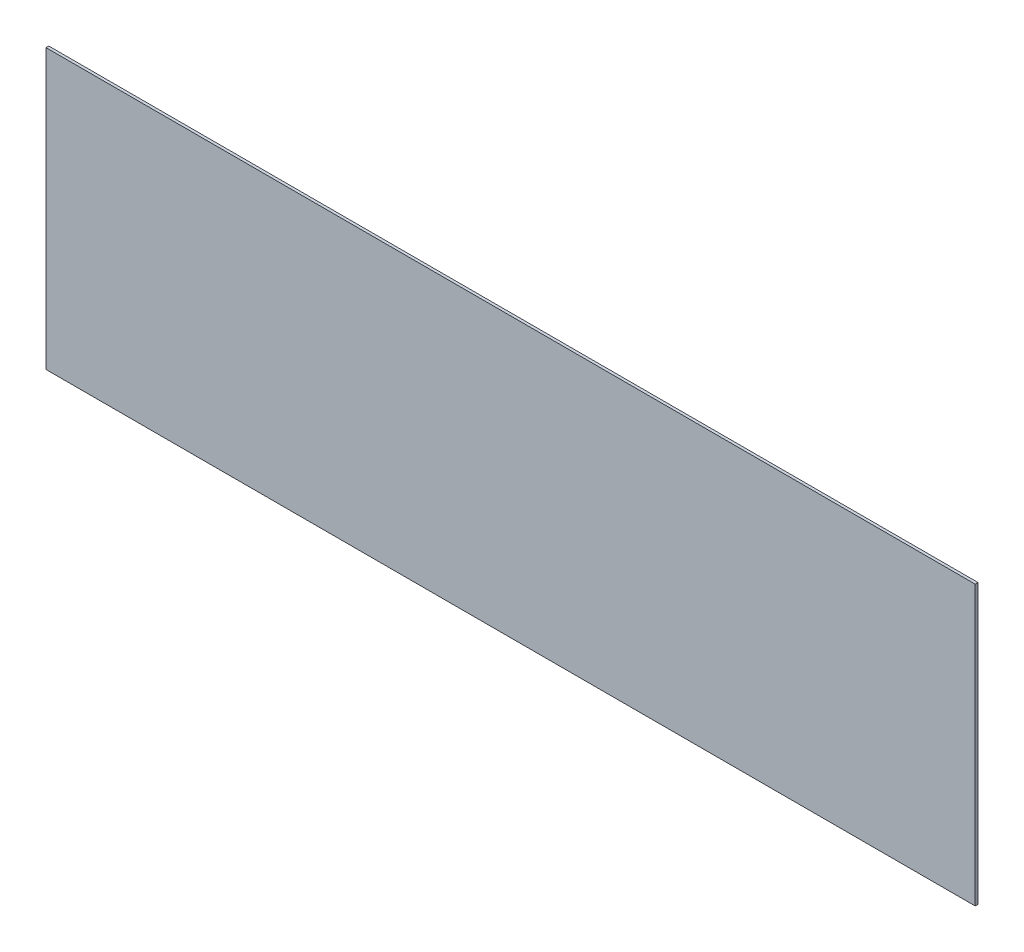
ISO-10303-21;
HEADER;
FILE_DESCRIPTION(('STEP AP214'),'2;1');
FILE_NAME('part.step','',(''),(''),'','','');
FILE_SCHEMA(('AUTOMOTIVE_DESIGN { 1 0 10303 214 1 1 1 1 }'));
ENDSEC;
DATA;
#1=APPLICATION_CONTEXT('core data for automotive mechanical design processes');
#2=APPLICATION_PROTOCOL_DEFINITION('international standard','automotive_design',2000,#1);
#3=PRODUCT_CONTEXT('',#1,'mechanical');
#4=PRODUCT('Part','Part','',(#3));
#5=PRODUCT_RELATED_PRODUCT_CATEGORY('part','',(#4));
#6=PRODUCT_DEFINITION_FORMATION('','',#4);
#7=PRODUCT_DEFINITION_CONTEXT('part definition',#1,'design');
#8=PRODUCT_DEFINITION('design','',#6,#7);
#9=PRODUCT_DEFINITION_SHAPE('','',#8);
#10=(LENGTH_UNIT() NAMED_UNIT(*) SI_UNIT(.MILLI.,.METRE.));
#11=(NAMED_UNIT(*) PLANE_ANGLE_UNIT() SI_UNIT($,.RADIAN.));
#12=(NAMED_UNIT(*) SI_UNIT($,.STERADIAN.) SOLID_ANGLE_UNIT());
#13=UNCERTAINTY_MEASURE_WITH_UNIT(LENGTH_MEASURE(1.E-05),#10,'distance_accuracy_value','');
#14=(GEOMETRIC_REPRESENTATION_CONTEXT(3) GLOBAL_UNCERTAINTY_ASSIGNED_CONTEXT((#13)) GLOBAL_UNIT_ASSIGNED_CONTEXT((#10,
#11,#12)) REPRESENTATION_CONTEXT('',''));
#15=CARTESIAN_POINT('',(0.,0.,0.));
#16=DIRECTION('',(0.,0.,1.));
#17=DIRECTION('',(1.,0.,0.));
#18=AXIS2_PLACEMENT_3D('',#15,#16,#17);
#19=CARTESIAN_POINT('',(0.,0.,1.5));
#20=DIRECTION('',(1.,0.,0.));
#21=DIRECTION('',(0.,0.,-1.));
#22=AXIS2_PLACEMENT_3D('',#19,#20,#21);
#23=PLANE('',#22);
#24=DIRECTION('',(0.,-1.,0.));
#25=VECTOR('',#24,1.);
#26=CARTESIAN_POINT('',(0.,0.,0.));
#27=LINE('',#26,#25);
#28=CARTESIAN_POINT('',(0.,0.,0.));
#29=VERTEX_POINT('',#28);
#30=CARTESIAN_POINT('',(0.,-150.,0.));
#31=VERTEX_POINT('',#30);
#32=EDGE_CURVE('E107',#29,#31,#27,.T.);
#33=ORIENTED_EDGE('',*,*,#32,.T.);
#34=DIRECTION('',(0.,0.,-1.));
#35=VECTOR('',#34,1.);
#36=CARTESIAN_POINT('',(0.,-150.,1.5));
#37=LINE('',#36,#35);
#38=CARTESIAN_POINT('',(0.,-150.,1.5));
#39=VERTEX_POINT('',#38);
#40=EDGE_CURVE('E11',#39,#31,#37,.T.);
#41=ORIENTED_EDGE('',*,*,#40,.F.);
#42=DIRECTION('',(0.,-1.,0.));
#43=VECTOR('',#42,1.);
#44=CARTESIAN_POINT('',(0.,0.,1.5));
#45=LINE('',#44,#43);
#46=CARTESIAN_POINT('',(0.,0.,1.5));
#47=VERTEX_POINT('',#46);
#48=EDGE_CURVE('E91',#47,#39,#45,.T.);
#49=ORIENTED_EDGE('',*,*,#48,.F.);
#50=DIRECTION('',(0.,0.,-1.));
#51=VECTOR('',#50,1.);
#52=CARTESIAN_POINT('',(0.,0.,1.5));
#53=LINE('',#52,#51);
#54=EDGE_CURVE('E103',#47,#29,#53,.T.);
#55=ORIENTED_EDGE('',*,*,#54,.T.);
#56=EDGE_LOOP('',(#33,#41,#49,#55));
#57=FACE_BOUND('',#56,.T.);
#58=ADVANCED_FACE('F39',(#57),#23,.F.);
#59=CARTESIAN_POINT('',(0.,-150.,1.5));
#60=DIRECTION('',(0.,1.,0.));
#61=DIRECTION('',(0.,0.,1.));
#62=AXIS2_PLACEMENT_3D('',#59,#60,#61);
#63=PLANE('',#62);
#64=DIRECTION('',(1.,0.,0.));
#65=VECTOR('',#64,1.);
#66=CARTESIAN_POINT('',(0.,-150.,0.));
#67=LINE('',#66,#65);
#68=CARTESIAN_POINT('',(500.,-150.,0.));
#69=VERTEX_POINT('',#68);
#70=EDGE_CURVE('E96',#31,#69,#67,.T.);
#71=ORIENTED_EDGE('',*,*,#70,.T.);
#72=DIRECTION('',(0.,0.,-1.));
#73=VECTOR('',#72,1.);
#74=CARTESIAN_POINT('',(500.,-150.,1.5));
#75=LINE('',#74,#73);
#76=CARTESIAN_POINT('',(500.,-150.,1.5));
#77=VERTEX_POINT('',#76);
#78=EDGE_CURVE('E48',#77,#69,#75,.T.);
#79=ORIENTED_EDGE('',*,*,#78,.F.);
#80=DIRECTION('',(1.,0.,0.));
#81=VECTOR('',#80,1.);
#82=CARTESIAN_POINT('',(0.,-150.,1.5));
#83=LINE('',#82,#81);
#84=EDGE_CURVE('E86',#39,#77,#83,.T.);
#85=ORIENTED_EDGE('',*,*,#84,.F.);
#86=ORIENTED_EDGE('',*,*,#40,.T.);
#87=EDGE_LOOP('',(#71,#79,#85,#86));
#88=FACE_BOUND('',#87,.T.);
#89=ADVANCED_FACE('F95',(#88),#63,.F.);
#90=CARTESIAN_POINT('',(500.,0.,1.5));
#91=DIRECTION('',(-1.,0.,0.));
#92=DIRECTION('',(0.,0.,1.));
#93=AXIS2_PLACEMENT_3D('',#90,#91,#92);
#94=PLANE('',#93);
#95=DIRECTION('',(0.,1.,0.));
#96=VECTOR('',#95,1.);
#97=CARTESIAN_POINT('',(500.,0.,0.));
#98=LINE('',#97,#96);
#99=CARTESIAN_POINT('',(500.,0.,0.));
#100=VERTEX_POINT('',#99);
#101=EDGE_CURVE('E73',#69,#100,#98,.T.);
#102=ORIENTED_EDGE('',*,*,#101,.T.);
#103=DIRECTION('',(0.,0.,-1.));
#104=VECTOR('',#103,1.);
#105=CARTESIAN_POINT('',(500.,0.,1.5));
#106=LINE('',#105,#104);
#107=CARTESIAN_POINT('',(500.,0.,1.5));
#108=VERTEX_POINT('',#107);
#109=EDGE_CURVE('E98',#108,#100,#106,.T.);
#110=ORIENTED_EDGE('',*,*,#109,.F.);
#111=DIRECTION('',(0.,1.,0.));
#112=VECTOR('',#111,1.);
#113=CARTESIAN_POINT('',(500.,0.,1.5));
#114=LINE('',#113,#112);
#115=EDGE_CURVE('E89',#77,#108,#114,.T.);
#116=ORIENTED_EDGE('',*,*,#115,.F.);
#117=ORIENTED_EDGE('',*,*,#78,.T.);
#118=EDGE_LOOP('',(#102,#110,#116,#117));
#119=FACE_BOUND('',#118,.T.);
#120=ADVANCED_FACE('F99',(#119),#94,.F.);
#121=CARTESIAN_POINT('',(0.,0.,1.5));
#122=DIRECTION('',(0.,-1.,0.));
#123=DIRECTION('',(0.,0.,-1.));
#124=AXIS2_PLACEMENT_3D('',#121,#122,#123);
#125=PLANE('',#124);
#126=DIRECTION('',(-1.,0.,0.));
#127=VECTOR('',#126,1.);
#128=CARTESIAN_POINT('',(0.,0.,0.));
#129=LINE('',#128,#127);
#130=EDGE_CURVE('E79',#100,#29,#129,.T.);
#131=ORIENTED_EDGE('',*,*,#130,.T.);
#132=ORIENTED_EDGE('',*,*,#54,.F.);
#133=DIRECTION('',(-1.,0.,0.));
#134=VECTOR('',#133,1.);
#135=CARTESIAN_POINT('',(0.,0.,1.5));
#136=LINE('',#135,#134);
#137=EDGE_CURVE('E56',#108,#47,#136,.T.);
#138=ORIENTED_EDGE('',*,*,#137,.F.);
#139=ORIENTED_EDGE('',*,*,#109,.T.);
#140=EDGE_LOOP('',(#131,#132,#138,#139));
#141=FACE_BOUND('',#140,.T.);
#142=ADVANCED_FACE('F120',(#141),#125,.F.);
#143=CARTESIAN_POINT('',(0.,0.,1.5));
#144=DIRECTION('',(0.,0.,1.));
#145=DIRECTION('',(1.,0.,0.));
#146=AXIS2_PLACEMENT_3D('',#143,#144,#145);
#147=PLANE('',#146);
#148=ORIENTED_EDGE('',*,*,#48,.T.);
#149=ORIENTED_EDGE('',*,*,#84,.T.);
#150=ORIENTED_EDGE('',*,*,#115,.T.);
#151=ORIENTED_EDGE('',*,*,#137,.T.);
#152=EDGE_LOOP('',(#148,#149,#150,#151));
#153=FACE_BOUND('',#152,.T.);
#154=ADVANCED_FACE('F87',(#153),#147,.T.);
#155=CARTESIAN_POINT('',(0.,0.,0.));
#156=DIRECTION('',(0.,0.,1.));
#157=DIRECTION('',(1.,0.,0.));
#158=AXIS2_PLACEMENT_3D('',#155,#156,#157);
#159=PLANE('',#158);
#160=ORIENTED_EDGE('',*,*,#32,.F.);
#161=ORIENTED_EDGE('',*,*,#130,.F.);
#162=ORIENTED_EDGE('',*,*,#101,.F.);
#163=ORIENTED_EDGE('',*,*,#70,.F.);
#164=EDGE_LOOP('',(#160,#161,#162,#163));
#165=FACE_BOUND('',#164,.T.);
#166=ADVANCED_FACE('F123',(#165),#159,.F.);
#167=CLOSED_SHELL('',(#58,#89,#120,#142,#154,#166));
#168=MANIFOLD_SOLID_BREP('B2',#167);
#169=ADVANCED_BREP_SHAPE_REPRESENTATION('',(#18,#168),#14);
#170=SHAPE_DEFINITION_REPRESENTATION(#9,#169);
ENDSEC;
END-ISO-10303-21;
